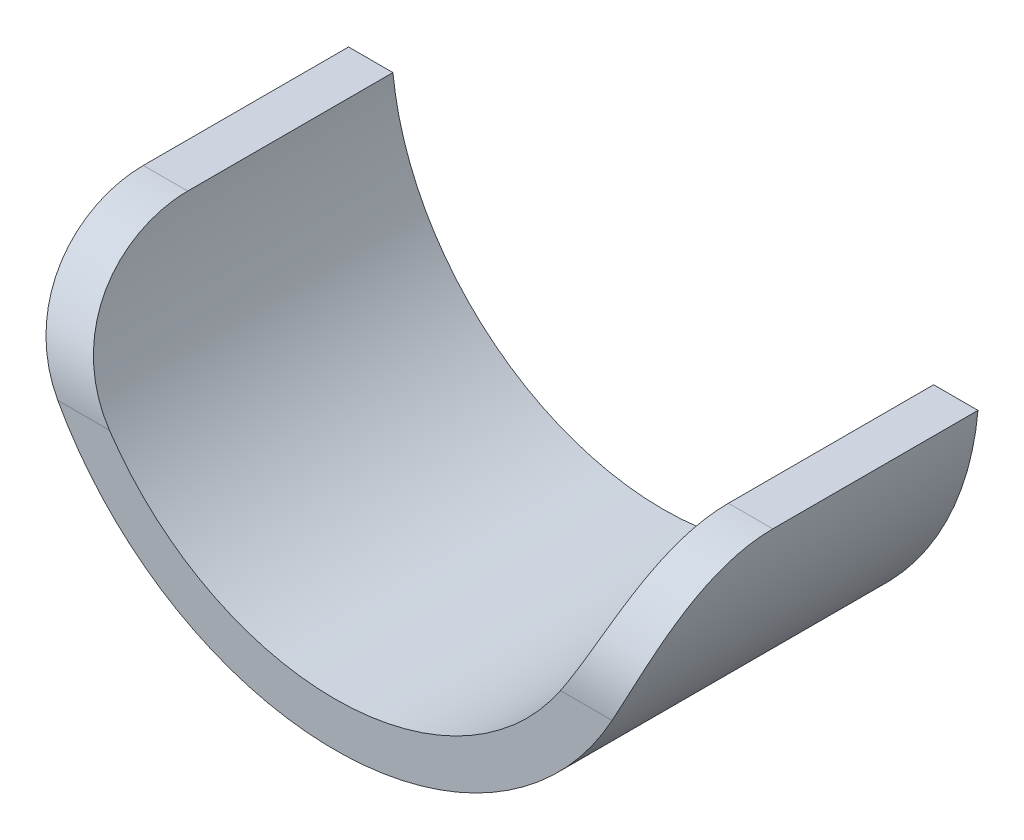
ISO-10303-21;
HEADER;
FILE_DESCRIPTION(('STEP AP214'),'2;1');
FILE_NAME('part.step','',(''),(''),'','','');
FILE_SCHEMA(('AUTOMOTIVE_DESIGN { 1 0 10303 214 1 1 1 1 }'));
ENDSEC;
DATA;
#1=APPLICATION_CONTEXT('core data for automotive mechanical design processes');
#2=APPLICATION_PROTOCOL_DEFINITION('international standard','automotive_design',2000,#1);
#3=PRODUCT_CONTEXT('',#1,'mechanical');
#4=PRODUCT('Part','Part','',(#3));
#5=PRODUCT_RELATED_PRODUCT_CATEGORY('part','',(#4));
#6=PRODUCT_DEFINITION_FORMATION('','',#4);
#7=PRODUCT_DEFINITION_CONTEXT('part definition',#1,'design');
#8=PRODUCT_DEFINITION('design','',#6,#7);
#9=PRODUCT_DEFINITION_SHAPE('','',#8);
#10=(LENGTH_UNIT() NAMED_UNIT(*) SI_UNIT(.MILLI.,.METRE.));
#11=(NAMED_UNIT(*) PLANE_ANGLE_UNIT() SI_UNIT($,.RADIAN.));
#12=(NAMED_UNIT(*) SI_UNIT($,.STERADIAN.) SOLID_ANGLE_UNIT());
#13=UNCERTAINTY_MEASURE_WITH_UNIT(LENGTH_MEASURE(1.E-05),#10,'distance_accuracy_value','');
#14=(GEOMETRIC_REPRESENTATION_CONTEXT(3) GLOBAL_UNCERTAINTY_ASSIGNED_CONTEXT((#13)) GLOBAL_UNIT_ASSIGNED_CONTEXT((#10,
#11,#12)) REPRESENTATION_CONTEXT('',''));
#15=CARTESIAN_POINT('',(0.,0.,0.));
#16=DIRECTION('',(0.,0.,1.));
#17=DIRECTION('',(1.,0.,0.));
#18=AXIS2_PLACEMENT_3D('',#15,#16,#17);
#19=CARTESIAN_POINT('',(-49.452517213227,70.5784102954188,0.));
#20=DIRECTION('',(0.,0.,1.));
#21=DIRECTION('',(1.,0.,0.));
#22=AXIS2_PLACEMENT_3D('',#19,#20,#21);
#23=CYLINDRICAL_SURFACE('',#22,21.0312);
#24=DIRECTION('',(0.,0.,1.));
#25=VECTOR('',#24,1.);
#26=CARTESIAN_POINT('',(-28.5390797341802,68.3559102954188,0.));
#27=LINE('',#26,#25);
#28=CARTESIAN_POINT('',(-28.5390797341802,68.3559102954188,0.));
#29=VERTEX_POINT('',#28);
#30=CARTESIAN_POINT('',(-28.5390797341802,68.3559102954188,15.875));
#31=VERTEX_POINT('',#30);
#32=EDGE_CURVE('E79',#29,#31,#27,.T.);
#33=ORIENTED_EDGE('',*,*,#32,.F.);
#34=CARTESIAN_POINT('',(-49.452517213227,70.5784102954188,0.));
#35=DIRECTION('',(0.,0.,1.));
#36=DIRECTION('',(1.,0.,0.));
#37=AXIS2_PLACEMENT_3D('',#34,#35,#36);
#38=CIRCLE('',#37,21.0312);
#39=CARTESIAN_POINT('',(-70.3659546922738,68.3559102954188,0.));
#40=VERTEX_POINT('',#39);
#41=EDGE_CURVE('E21',#29,#40,#38,.F.);
#42=ORIENTED_EDGE('',*,*,#41,.T.);
#43=DIRECTION('',(0.,0.,1.));
#44=VECTOR('',#43,1.);
#45=CARTESIAN_POINT('',(-70.3659546922738,68.3559102954188,0.));
#46=LINE('',#45,#44);
#47=CARTESIAN_POINT('',(-70.3659546922738,68.3559102954188,15.875));
#48=VERTEX_POINT('',#47);
#49=EDGE_CURVE('E94',#48,#40,#46,.F.);
#50=ORIENTED_EDGE('',*,*,#49,.F.);
#51=CARTESIAN_POINT('',(-66.8969322848194,58.8309102954188,25.4));
#52=CARTESIAN_POINT('',(-67.0552544886792,59.0659323458779,25.4000223165937));
#53=CARTESIAN_POINT('',(-67.2088070850555,59.3042788469614,25.3913001358398));
#54=CARTESIAN_POINT('',(-67.5056920364701,59.7861027177401,25.3550603951115));
#55=CARTESIAN_POINT('',(-67.6490162181507,60.0295839936756,25.3275279858859));
#56=CARTESIAN_POINT('',(-67.9249520253229,60.5205680650174,25.2522368031522));
#57=CARTESIAN_POINT('',(-68.0575278431865,60.7680812486983,25.2044134841059));
#58=CARTESIAN_POINT('',(-68.3107497253412,61.264124128635,25.0874914031118));
#59=CARTESIAN_POINT('',(-68.4313989286372,61.5126535393979,25.0183982590408));
#60=CARTESIAN_POINT('',(-68.6609196821141,62.0096321139726,24.8577555248676));
#61=CARTESIAN_POINT('',(-68.7697263309325,62.2580740592438,24.7660903705651));
#62=CARTESIAN_POINT('',(-68.9745996037871,62.7508386516952,24.5601076647881));
#63=CARTESIAN_POINT('',(-69.0706650630401,62.9951609204801,24.4457880446508));
#64=CARTESIAN_POINT('',(-69.2498955560648,63.4762318935547,24.194858409047));
#65=CARTESIAN_POINT('',(-69.3330891377015,63.7129964057611,24.0582991407832));
#66=CARTESIAN_POINT('',(-69.4871936315312,64.1766299263025,23.7632437137221));
#67=CARTESIAN_POINT('',(-69.5581058048297,64.4034999488523,23.6047498102739));
#68=CARTESIAN_POINT('',(-69.6823993225229,64.8245434047757,23.2821462690892));
#69=CARTESIAN_POINT('',(-69.7367878326565,65.0198152051915,23.119853352547));
#70=CARTESIAN_POINT('',(-69.8366441450998,65.3979675157972,22.7789250447289));
#71=CARTESIAN_POINT('',(-69.8821124486974,65.5808487219216,22.6002905726256));
#72=CARTESIAN_POINT('',(-69.9649622014433,65.9325888462051,22.227752368041));
#73=CARTESIAN_POINT('',(-70.0023382664183,66.1014383826418,22.0338385857608));
#74=CARTESIAN_POINT('',(-70.0698551050343,66.423434678197,21.6322082114785));
#75=CARTESIAN_POINT('',(-70.099995846967,66.5765813684971,21.4244915589915));
#76=CARTESIAN_POINT('',(-70.1535673245214,66.8637200119019,20.9998729669769));
#77=CARTESIAN_POINT('',(-70.1770896614874,66.9979591306583,20.7831495666458));
#78=CARTESIAN_POINT('',(-70.2188684352495,67.2488146613606,20.339247528795));
#79=CARTESIAN_POINT('',(-70.2371248103863,67.3654308669517,20.1120687688893));
#80=CARTESIAN_POINT('',(-70.2691787972043,67.580118012179,19.6488760229002));
#81=CARTESIAN_POINT('',(-70.2829773870763,67.6781930184271,19.4128639878406));
#82=CARTESIAN_POINT('',(-70.3068437066333,67.8551007195252,18.933570469802));
#83=CARTESIAN_POINT('',(-70.3169117991028,67.9339352852207,18.6902896961832));
#84=CARTESIAN_POINT('',(-70.3326326637004,68.0613457872681,18.2354445333753));
#85=CARTESIAN_POINT('',(-70.3387235405181,68.1126977301863,18.0246672540239));
#86=CARTESIAN_POINT('',(-70.3489474268305,68.2009031201129,17.6000705633836));
#87=CARTESIAN_POINT('',(-70.3530806454631,68.2377581157685,17.3862514795677));
#88=CARTESIAN_POINT('',(-70.3596072613835,68.2967682226221,16.9567155095835));
#89=CARTESIAN_POINT('',(-70.362001814267,68.3189330966812,16.7409999805665));
#90=CARTESIAN_POINT('',(-70.3651678474338,68.3485113571974,16.3085236213267));
#91=CARTESIAN_POINT('',(-70.3659391437129,68.3559230713058,16.0917626753916));
#92=CARTESIAN_POINT('',(-70.3659546922738,68.3559102954188,15.875));
#93=B_SPLINE_CURVE_WITH_KNOTS('',3,(#51,#52,#53,#54,#55,#56,#57,#58,#59,#60,#61,#62,#63,#64,#65,
#66,#67,#68,#69,#70,#71,#72,#73,#74,#75,#76,#77,#78,#79,#80,#81,#82,#83,#84,#85,#86,#87,#88,#89,
#90,#91,#92),.UNSPECIFIED.,.F.,.F.,(4,2,2,2,2,2,2,2,2,2,2,2,2,2,2,2,2,2,2,2,4),(0.,
0.850069177057508,1.70081019595331,2.55427796092164,3.40752049747346,4.26522576280219,
5.12300938448019,5.97886242616629,6.8346275331647,7.6126869954961,8.39070272076813,
9.1692345189757,9.94776972898546,10.7149303049624,11.4820998632821,12.2491009638168,
13.0160274552093,13.6666131714847,14.3171293695712,14.9672128084942,15.6173699336167),.UNSPECIFIED.);
#94=CARTESIAN_POINT('',(-66.8969322848194,58.8309102954188,25.4));
#95=VERTEX_POINT('',#94);
#96=EDGE_CURVE('E119',#95,#48,#93,.T.);
#97=ORIENTED_EDGE('',*,*,#96,.F.);
#98=CARTESIAN_POINT('',(-49.452517213227,70.5784102954188,25.4));
#99=DIRECTION('',(0.,0.,1.));
#100=DIRECTION('',(1.,0.,0.));
#101=AXIS2_PLACEMENT_3D('',#98,#99,#100);
#102=CIRCLE('',#101,21.0312);
#103=CARTESIAN_POINT('',(-32.0081021416346,58.8309102954188,25.4));
#104=VERTEX_POINT('',#103);
#105=EDGE_CURVE('E127',#104,#95,#102,.F.);
#106=ORIENTED_EDGE('',*,*,#105,.F.);
#107=CARTESIAN_POINT('',(-28.5390797341802,68.3559102954188,15.875));
#108=CARTESIAN_POINT('',(-28.5391142013546,68.355939343475,16.1398670139382));
#109=CARTESIAN_POINT('',(-28.5402548882162,68.3448635346954,16.4047317584034));
#110=CARTESIAN_POINT('',(-28.5449977748069,68.3007103168477,16.9325968588688));
#111=CARTESIAN_POINT('',(-28.5485999535491,68.2676330953663,17.1955972307456));
#112=CARTESIAN_POINT('',(-28.5585141886226,68.1796913757452,17.7178413974937));
#113=CARTESIAN_POINT('',(-28.5648258617715,68.124829958455,17.9770857181967));
#114=CARTESIAN_POINT('',(-28.5806408134085,67.9937374624602,18.4900104702357));
#115=CARTESIAN_POINT('',(-28.5901440291559,67.9175068038448,18.743691010842));
#116=CARTESIAN_POINT('',(-28.6129834610961,67.7441839771652,19.2438704663273));
#117=CARTESIAN_POINT('',(-28.6263226663458,67.6470755558047,19.4903636150804));
#118=CARTESIAN_POINT('',(-28.6576089612104,67.4327971512381,19.9741655654518));
#119=CARTESIAN_POINT('',(-28.6755559716713,67.3156275126598,20.2114745247577));
#120=CARTESIAN_POINT('',(-28.7169386684408,67.0622157029794,20.6751051204218));
#121=CARTESIAN_POINT('',(-28.7403729475251,66.9259784254209,20.9014295558545));
#122=CARTESIAN_POINT('',(-28.7936879319491,66.6355777501028,21.3414684393254));
#123=CARTESIAN_POINT('',(-28.82356851396,66.4814146953202,21.55518312851));
#124=CARTESIAN_POINT('',(-28.8903509027463,66.158508439211,21.9659236247951));
#125=CARTESIAN_POINT('',(-28.9271639261132,65.9899629328477,22.1631192608108));
#126=CARTESIAN_POINT('',(-29.0089555654543,65.6382951840114,22.5422318664961));
#127=CARTESIAN_POINT('',(-29.0539341165306,65.4551730573969,22.7241489575796));
#128=CARTESIAN_POINT('',(-29.1528631627412,65.0762540393745,23.0713388734296));
#129=CARTESIAN_POINT('',(-29.2068077893987,64.8804654892568,23.2366224722856));
#130=CARTESIAN_POINT('',(-29.324396747058,64.4780775248516,23.5496398476285));
#131=CARTESIAN_POINT('',(-29.388040816974,64.271478401657,23.6973740963112));
#132=CARTESIAN_POINT('',(-29.5237661900075,63.8550970610708,23.9708999474789));
#133=CARTESIAN_POINT('',(-29.5955838890426,63.6455387041543,24.097163660142));
#134=CARTESIAN_POINT('',(-29.7492328383273,63.2202123199118,24.3318700223195));
#135=CARTESIAN_POINT('',(-29.8310640565333,63.0044443124587,24.4403127288593));
#136=CARTESIAN_POINT('',(-30.0049748934319,62.5684394740868,24.639360644988));
#137=CARTESIAN_POINT('',(-30.0970689974614,62.3481966949511,24.7299401298034));
#138=CARTESIAN_POINT('',(-30.291323314875,61.9055539376429,24.8931949707997));
#139=CARTESIAN_POINT('',(-30.3934831010586,61.6831540513816,24.9658710863647));
#140=CARTESIAN_POINT('',(-30.6078815253485,61.2375126189153,25.093881459011));
#141=CARTESIAN_POINT('',(-30.7201446452316,61.0142703564028,25.1491720494189));
#142=CARTESIAN_POINT('',(-30.9541477208969,60.5691667913567,25.2428080919879));
#143=CARTESIAN_POINT('',(-31.0758894680624,60.3473057584624,25.2811503318617));
#144=CARTESIAN_POINT('',(-31.327975004665,59.9071205524767,25.3416050571915));
#145=CARTESIAN_POINT('',(-31.4582945246274,59.6887884077823,25.3637613541451));
#146=CARTESIAN_POINT('',(-31.7271617572415,59.2563859003366,25.3929612260503));
#147=CARTESIAN_POINT('',(-31.865704584105,59.0423131059243,25.4000136842187));
#148=CARTESIAN_POINT('',(-32.0081021416346,58.8309102954188,25.4));
#149=B_SPLINE_CURVE_WITH_KNOTS('',3,(#107,#108,#109,#110,#111,#112,#113,#114,#115,#116,#117,
#118,#119,#120,#121,#122,#123,#124,#125,#126,#127,#128,#129,#130,#131,#132,#133,#134,#135,#136,
#137,#138,#139,#140,#141,#142,#143,#144,#145,#146,#147,#148),.UNSPECIFIED.,.F.,.F.,(4,2,2,2,2,2,
2,2,2,2,2,2,2,2,2,2,2,2,2,2,4),(0.,0.794364250872307,1.58872172898608,2.38296690436665,
3.17719646709986,3.97204658943479,4.76688305855899,5.5615159125989,6.35613356529251,
7.1411926113294,7.92624541814851,8.71078640108747,9.49530626980127,10.2593476802903,
11.0233866458804,11.7885179934618,12.5536168818675,13.320622372447,14.0877731743138,
14.8528397088216,15.6174561511034),.UNSPECIFIED.);
#150=EDGE_CURVE('E81',#31,#104,#149,.T.);
#151=ORIENTED_EDGE('',*,*,#150,.F.);
#152=EDGE_LOOP('',(#33,#42,#50,#97,#106,#151));
#153=FACE_BOUND('',#152,.T.);
#154=ADVANCED_FACE('F17',(#153),#23,.F.);
#155=CARTESIAN_POINT('',(-49.452517213227,57.0124976223337,0.));
#156=DIRECTION('',(0.,0.,1.));
#157=DIRECTION('',(1.,0.,0.));
#158=AXIS2_PLACEMENT_3D('',#155,#156,#157);
#159=PLANE('',#158);
#160=ORIENTED_EDGE('',*,*,#41,.F.);
#161=DIRECTION('',(1.,0.,0.));
#162=VECTOR('',#161,1.);
#163=CARTESIAN_POINT('',(-28.5390797341803,68.3559102954188,0.));
#164=LINE('',#163,#162);
#165=CARTESIAN_POINT('',(-25.1062495321224,68.3559102954188,0.));
#166=VERTEX_POINT('',#165);
#167=EDGE_CURVE('E71',#166,#29,#164,.F.);
#168=ORIENTED_EDGE('',*,*,#167,.F.);
#169=CARTESIAN_POINT('',(-49.452517213227,70.5784102954188,0.));
#170=DIRECTION('',(0.,0.,1.));
#171=DIRECTION('',(1.,0.,0.));
#172=AXIS2_PLACEMENT_3D('',#169,#170,#171);
#173=CIRCLE('',#172,24.4475);
#174=CARTESIAN_POINT('',(-73.7987848943316,68.3559102954188,0.));
#175=VERTEX_POINT('',#174);
#176=EDGE_CURVE('E95',#175,#166,#173,.T.);
#177=ORIENTED_EDGE('',*,*,#176,.F.);
#178=DIRECTION('',(1.,0.,0.));
#179=VECTOR('',#178,1.);
#180=CARTESIAN_POINT('',(-73.7987848943316,68.3559102954188,0.));
#181=LINE('',#180,#179);
#182=EDGE_CURVE('E74',#40,#175,#181,.F.);
#183=ORIENTED_EDGE('',*,*,#182,.F.);
#184=EDGE_LOOP('',(#160,#168,#177,#183));
#185=FACE_BOUND('',#184,.T.);
#186=ADVANCED_FACE('F69',(#185),#159,.F.);
#187=CARTESIAN_POINT('',(-28.5390797341803,68.3559102954188,0.));
#188=DIRECTION('',(0.,1.,0.));
#189=DIRECTION('',(0.,0.,1.));
#190=AXIS2_PLACEMENT_3D('',#187,#188,#189);
#191=PLANE('',#190);
#192=DIRECTION('',(1.,0.,0.));
#193=VECTOR('',#192,1.);
#194=CARTESIAN_POINT('',(-38.9957984737035,68.3559102954188,15.875));
#195=LINE('',#194,#193);
#196=CARTESIAN_POINT('',(-25.1062495321224,68.3559102954188,15.875));
#197=VERTEX_POINT('',#196);
#198=EDGE_CURVE('E92',#197,#31,#195,.F.);
#199=ORIENTED_EDGE('',*,*,#198,.F.);
#200=DIRECTION('',(0.,0.,1.));
#201=VECTOR('',#200,1.);
#202=CARTESIAN_POINT('',(-25.1062495321224,68.3559102954188,0.));
#203=LINE('',#202,#201);
#204=EDGE_CURVE('E87',#166,#197,#203,.T.);
#205=ORIENTED_EDGE('',*,*,#204,.F.);
#206=ORIENTED_EDGE('',*,*,#167,.T.);
#207=ORIENTED_EDGE('',*,*,#32,.T.);
#208=EDGE_LOOP('',(#199,#205,#206,#207));
#209=FACE_BOUND('',#208,.T.);
#210=ADVANCED_FACE('F85',(#209),#191,.T.);
#211=CARTESIAN_POINT('',(-38.9957984737035,58.8309102954188,15.875));
#212=DIRECTION('',(1.,0.,0.));
#213=DIRECTION('',(0.,0.,-1.));
#214=AXIS2_PLACEMENT_3D('',#211,#212,#213);
#215=CYLINDRICAL_SURFACE('',#214,9.525);
#216=CARTESIAN_POINT('',(-25.1062495321224,68.3559102954188,15.875));
#217=CARTESIAN_POINT('',(-25.1062794182222,68.355939289013,16.1406587450787));
#218=CARTESIAN_POINT('',(-25.1072650314546,68.3447973908505,16.4063147471648));
#219=CARTESIAN_POINT('',(-25.1113636911725,68.3003799556767,16.9357487854177));
#220=CARTESIAN_POINT('',(-25.1144766979883,68.2671048313855,17.1995268565098));
#221=CARTESIAN_POINT('',(-25.1230448036789,68.1786425497196,17.7232628183113));
#222=CARTESIAN_POINT('',(-25.1284991888284,68.1234620701662,17.9832218482288));
#223=CARTESIAN_POINT('',(-25.1421673489193,67.9916043532497,18.4975516871316));
#224=CARTESIAN_POINT('',(-25.1503810748437,67.9149274977529,18.7519225952988));
#225=CARTESIAN_POINT('',(-25.1701225115088,67.7405852457916,19.2534385254365));
#226=CARTESIAN_POINT('',(-25.1816525551007,67.6429050868851,19.5005783254095));
#227=CARTESIAN_POINT('',(-25.2086974516839,67.4273384134945,19.9856553708156));
#228=CARTESIAN_POINT('',(-25.2242122541399,67.3094521552733,20.2235927329113));
#229=CARTESIAN_POINT('',(-25.2599893150932,67.0544331040269,20.6884777653377));
#230=CARTESIAN_POINT('',(-25.2802504789706,66.9173047515894,20.9154279550222));
#231=CARTESIAN_POINT('',(-25.3263498108991,66.6249058717589,21.3567254564923));
#232=CARTESIAN_POINT('',(-25.3521878930276,66.4696356238916,21.5710729623805));
#233=CARTESIAN_POINT('',(-25.4100309114188,66.1437470511981,21.9837267762967));
#234=CARTESIAN_POINT('',(-25.4419784080376,65.9732790121655,22.1821598082104));
#235=CARTESIAN_POINT('',(-25.5129957338972,65.6173122424646,22.5636798258997));
#236=CARTESIAN_POINT('',(-25.5520655286617,65.4318135845561,22.746766885953));
#237=CARTESIAN_POINT('',(-25.6380554565465,65.0475512936221,23.0962476410932));
#238=CARTESIAN_POINT('',(-25.684972049953,64.848793665951,23.2626488093378));
#239=CARTESIAN_POINT('',(-25.7873097124542,64.4397920218163,23.5777730993106));
#240=CARTESIAN_POINT('',(-25.8427305846889,64.2295482713098,23.7264966301056));
#241=CARTESIAN_POINT('',(-25.961412935882,63.8037392642261,24.00271480155));
#242=CARTESIAN_POINT('',(-26.0245013298024,63.5883565328607,24.1305654932742));
#243=CARTESIAN_POINT('',(-26.1596506288141,63.1504140363118,24.3679114252697));
#244=CARTESIAN_POINT('',(-26.2317116155073,62.9278542058693,24.4774064985832));
#245=CARTESIAN_POINT('',(-26.3850185741505,62.4773342177492,24.6778442802186));
#246=CARTESIAN_POINT('',(-26.4662732964222,62.2493690813373,24.7687690791281));
#247=CARTESIAN_POINT('',(-26.6378736954581,61.7902164755443,24.9319026085443));
#248=CARTESIAN_POINT('',(-26.7282186524823,61.5590292625252,25.0041128192051));
#249=CARTESIAN_POINT('',(-26.9085557066922,61.1179036853411,25.1239091993097));
#250=CARTESIAN_POINT('',(-26.9977241024106,60.908090265423,25.1732093144912));
#251=CARTESIAN_POINT('',(-27.1830608236447,60.4886055376733,25.2570799539002));
#252=CARTESIAN_POINT('',(-27.2792294211144,60.2789342356826,25.291649905511));
#253=CARTESIAN_POINT('',(-27.4779945066406,59.8614201022567,25.3464249237933));
#254=CARTESIAN_POINT('',(-27.5805747754399,59.6535740620191,25.3666647580956));
#255=CARTESIAN_POINT('',(-27.7919470287728,59.2402420222756,25.3934558910032));
#256=CARTESIAN_POINT('',(-27.9007371799733,59.0347553475176,25.4000112084111));
#257=CARTESIAN_POINT('',(-28.0124495827366,58.8309102954188,25.4));
#258=B_SPLINE_CURVE_WITH_KNOTS('',3,(#216,#217,#218,#219,#220,#221,#222,#223,#224,#225,#226,
#227,#228,#229,#230,#231,#232,#233,#234,#235,#236,#237,#238,#239,#240,#241,#242,#243,#244,#245,
#246,#247,#248,#249,#250,#251,#252,#253,#254,#255,#256,#257),.UNSPECIFIED.,.F.,.F.,(4,2,2,2,2,2,
2,2,2,2,2,2,2,2,2,2,2,2,2,2,4),(0.,0.796737246428706,1.59345963644868,2.38993933288703,
3.18640488138022,3.98343207658434,4.78044916427195,5.5772826221825,6.37410380429985,
7.16377221191817,7.95343679715734,8.74274611844911,9.5320371712921,10.3060065718731,
11.0799830118886,11.8547023963263,12.6293604887822,13.3285224691192,14.0277116260216,
14.7251985474629,15.4224806054855),.UNSPECIFIED.);
#259=CARTESIAN_POINT('',(-28.0124495827367,58.8309102954188,25.4));
#260=VERTEX_POINT('',#259);
#261=EDGE_CURVE('E140',#197,#260,#258,.T.);
#262=ORIENTED_EDGE('',*,*,#261,.F.);
#263=ORIENTED_EDGE('',*,*,#198,.T.);
#264=ORIENTED_EDGE('',*,*,#150,.T.);
#265=DIRECTION('',(1.,0.,0.));
#266=VECTOR('',#265,1.);
#267=CARTESIAN_POINT('',(-49.452517213227,58.8309102954188,25.4));
#268=LINE('',#267,#266);
#269=EDGE_CURVE('E129',#260,#104,#268,.F.);
#270=ORIENTED_EDGE('',*,*,#269,.F.);
#271=EDGE_LOOP('',(#262,#263,#264,#270));
#272=FACE_BOUND('',#271,.T.);
#273=ADVANCED_FACE('F134',(#272),#215,.T.);
#274=CARTESIAN_POINT('',(-49.452517213227,57.0124976223337,25.4));
#275=DIRECTION('',(0.,0.,1.));
#276=DIRECTION('',(1.,0.,0.));
#277=AXIS2_PLACEMENT_3D('',#274,#275,#276);
#278=PLANE('',#277);
#279=ORIENTED_EDGE('',*,*,#269,.T.);
#280=ORIENTED_EDGE('',*,*,#105,.T.);
#281=DIRECTION('',(1.,0.,0.));
#282=VECTOR('',#281,1.);
#283=CARTESIAN_POINT('',(-61.6256510537793,58.8309102954188,25.4));
#284=LINE('',#283,#282);
#285=CARTESIAN_POINT('',(-70.8925848437174,58.8309102954188,25.4));
#286=VERTEX_POINT('',#285);
#287=EDGE_CURVE('E126',#286,#95,#284,.T.);
#288=ORIENTED_EDGE('',*,*,#287,.F.);
#289=CARTESIAN_POINT('',(-49.452517213227,70.5784102954188,25.4));
#290=DIRECTION('',(0.,0.,1.));
#291=DIRECTION('',(1.,0.,0.));
#292=AXIS2_PLACEMENT_3D('',#289,#290,#291);
#293=CIRCLE('',#292,24.4475);
#294=EDGE_CURVE('E105',#260,#286,#293,.F.);
#295=ORIENTED_EDGE('',*,*,#294,.F.);
#296=EDGE_LOOP('',(#279,#280,#288,#295));
#297=FACE_BOUND('',#296,.T.);
#298=ADVANCED_FACE('F115',(#297),#278,.T.);
#299=CARTESIAN_POINT('',(-61.6256510537793,58.8309102954188,15.875));
#300=DIRECTION('',(1.,0.,0.));
#301=DIRECTION('',(0.,0.,-1.));
#302=AXIS2_PLACEMENT_3D('',#299,#300,#301);
#303=CYLINDRICAL_SURFACE('',#302,9.525);
#304=CARTESIAN_POINT('',(-70.8925848437174,58.8309102954188,25.4));
#305=CARTESIAN_POINT('',(-71.0266968626548,59.0755925258098,25.4000256457706));
#306=CARTESIAN_POINT('',(-71.1565868688513,59.3226722521849,25.3905709187918));
#307=CARTESIAN_POINT('',(-71.4073384066761,59.8200102851953,25.3517840634947));
#308=CARTESIAN_POINT('',(-71.528194440291,60.0702704207483,25.3224399382358));
#309=CARTESIAN_POINT('',(-71.7603745865899,60.5725821914308,25.2428716042871));
#310=CARTESIAN_POINT('',(-71.8716780626222,60.8246364914326,25.1926034977154));
#311=CARTESIAN_POINT('',(-72.083948684652,61.3278383710271,25.0705411360382));
#312=CARTESIAN_POINT('',(-72.1849179804794,61.578986128678,24.9987513703646));
#313=CARTESIAN_POINT('',(-72.376617860651,62.0791229436226,24.8329251428842));
#314=CARTESIAN_POINT('',(-72.4673052923306,62.3280991274512,24.7387997012281));
#315=CARTESIAN_POINT('',(-72.6378779024851,62.8203711804037,24.5284082958888));
#316=CARTESIAN_POINT('',(-72.7177622678843,63.0636666208367,24.4121406672935));
#317=CARTESIAN_POINT('',(-72.8667439392814,63.5415925622165,24.1580081534748));
#318=CARTESIAN_POINT('',(-72.9358590310641,63.7762368507453,24.0201796477769));
#319=CARTESIAN_POINT('',(-73.0638481153894,64.2347545003905,23.7234804891717));
#320=CARTESIAN_POINT('',(-73.1227228808604,64.4586286734998,23.5646114259783));
#321=CARTESIAN_POINT('',(-73.2271617424479,64.8784015858087,23.2383726016773));
#322=CARTESIAN_POINT('',(-73.2733592564402,65.0751672111943,23.0723185079716));
#323=CARTESIAN_POINT('',(-73.3580318631698,65.4554639498293,22.7238985809521));
#324=CARTESIAN_POINT('',(-73.3965072599205,65.6389955839075,22.5415333902014));
#325=CARTESIAN_POINT('',(-73.466489221536,65.9912883562984,22.1616334691098));
#326=CARTESIAN_POINT('',(-73.4979919980415,66.1600414351945,21.964090570558));
#327=CARTESIAN_POINT('',(-73.554796634011,66.4812175206149,21.5553157980747));
#328=CARTESIAN_POINT('',(-73.5800984942854,66.6336405292729,21.3440839259319));
#329=CARTESIAN_POINT('',(-73.6250984647816,66.9195410623861,20.9114932359871));
#330=CARTESIAN_POINT('',(-73.64484721287,67.0531838279528,20.6902488214772));
#331=CARTESIAN_POINT('',(-73.6798228662991,67.302173076768,20.2373513734024));
#332=CARTESIAN_POINT('',(-73.6950497372399,67.4175194208246,20.0056982606695));
#333=CARTESIAN_POINT('',(-73.7216889121856,67.6290165300981,19.5336644764603));
#334=CARTESIAN_POINT('',(-73.7331023072274,67.725172782431,19.2932863230781));
#335=CARTESIAN_POINT('',(-73.7527471407126,67.8976224337508,18.8054057085097));
#336=CARTESIAN_POINT('',(-73.7609790131866,67.9739185416401,18.557904224058));
#337=CARTESIAN_POINT('',(-73.7733459532473,68.0923887987073,18.1094370250623));
#338=CARTESIAN_POINT('',(-73.7779767433826,68.1383584791921,17.9094773368769));
#339=CARTESIAN_POINT('',(-73.7857653548148,68.2172963450834,17.5070007627129));
#340=CARTESIAN_POINT('',(-73.7889233871008,68.2502663927295,17.3044842473009));
#341=CARTESIAN_POINT('',(-73.7939158337533,68.3030397443443,16.897917414532));
#342=CARTESIAN_POINT('',(-73.7957514541939,68.3228550444869,16.6938686666993));
#343=CARTESIAN_POINT('',(-73.7981807484595,68.3492962939706,16.2848806494748));
#344=CARTESIAN_POINT('',(-73.7987742375292,68.3559202812222,16.0799412521494));
#345=CARTESIAN_POINT('',(-73.7987848943316,68.3559102954188,15.875));
#346=B_SPLINE_CURVE_WITH_KNOTS('',3,(#304,#305,#306,#307,#308,#309,#310,#311,#312,#313,#314,
#315,#316,#317,#318,#319,#320,#321,#322,#323,#324,#325,#326,#327,#328,#329,#330,#331,#332,#333,
#334,#335,#336,#337,#338,#339,#340,#341,#342,#343,#344,#345),.UNSPECIFIED.,.F.,.F.,(4,2,2,2,2,2,
2,2,2,2,2,2,2,2,2,2,2,2,2,2,4),(0.,0.836984414931259,1.67447413417505,2.51372980875849,
3.35281053574466,4.19529179613473,5.0378364292885,5.87897447860049,6.72004901216606,
7.5038464504336,8.28761302519436,9.0718043958299,9.85599566400656,10.6327852059722,
11.4095806571569,12.1861536762104,12.9626207159653,13.5778919193058,14.1930749509941,
14.8076962069896,15.4224088755558),.UNSPECIFIED.);
#347=CARTESIAN_POINT('',(-73.7987848943316,68.3559102954188,15.875));
#348=VERTEX_POINT('',#347);
#349=EDGE_CURVE('E27',#286,#348,#346,.T.);
#350=ORIENTED_EDGE('',*,*,#349,.F.);
#351=ORIENTED_EDGE('',*,*,#287,.T.);
#352=ORIENTED_EDGE('',*,*,#96,.T.);
#353=DIRECTION('',(1.,0.,0.));
#354=VECTOR('',#353,1.);
#355=CARTESIAN_POINT('',(-73.7987848943316,68.3559102954188,15.875));
#356=LINE('',#355,#354);
#357=EDGE_CURVE('E36',#348,#48,#356,.T.);
#358=ORIENTED_EDGE('',*,*,#357,.F.);
#359=EDGE_LOOP('',(#350,#351,#352,#358));
#360=FACE_BOUND('',#359,.T.);
#361=ADVANCED_FACE('F110',(#360),#303,.T.);
#362=CARTESIAN_POINT('',(-73.7987848943316,68.3559102954188,0.));
#363=DIRECTION('',(0.,1.,0.));
#364=DIRECTION('',(0.,0.,1.));
#365=AXIS2_PLACEMENT_3D('',#362,#363,#364);
#366=PLANE('',#365);
#367=ORIENTED_EDGE('',*,*,#357,.T.);
#368=ORIENTED_EDGE('',*,*,#49,.T.);
#369=ORIENTED_EDGE('',*,*,#182,.T.);
#370=DIRECTION('',(0.,0.,1.));
#371=VECTOR('',#370,1.);
#372=CARTESIAN_POINT('',(-73.7987848943316,68.3559102954188,0.));
#373=LINE('',#372,#371);
#374=EDGE_CURVE('E11',#348,#175,#373,.F.);
#375=ORIENTED_EDGE('',*,*,#374,.F.);
#376=EDGE_LOOP('',(#367,#368,#369,#375));
#377=FACE_BOUND('',#376,.T.);
#378=ADVANCED_FACE('F114',(#377),#366,.T.);
#379=CARTESIAN_POINT('',(-49.452517213227,70.5784102954188,0.));
#380=DIRECTION('',(0.,0.,1.));
#381=DIRECTION('',(1.,0.,0.));
#382=AXIS2_PLACEMENT_3D('',#379,#380,#381);
#383=CYLINDRICAL_SURFACE('',#382,24.4475);
#384=ORIENTED_EDGE('',*,*,#349,.T.);
#385=ORIENTED_EDGE('',*,*,#374,.T.);
#386=ORIENTED_EDGE('',*,*,#176,.T.);
#387=ORIENTED_EDGE('',*,*,#204,.T.);
#388=ORIENTED_EDGE('',*,*,#261,.T.);
#389=ORIENTED_EDGE('',*,*,#294,.T.);
#390=EDGE_LOOP('',(#384,#385,#386,#387,#388,#389));
#391=FACE_BOUND('',#390,.T.);
#392=ADVANCED_FACE('F107',(#391),#383,.T.);
#393=CLOSED_SHELL('',(#154,#186,#210,#273,#298,#361,#378,#392));
#394=MANIFOLD_SOLID_BREP('B1',#393);
#395=ADVANCED_BREP_SHAPE_REPRESENTATION('',(#18,#394),#14);
#396=SHAPE_DEFINITION_REPRESENTATION(#9,#395);
ENDSEC;
END-ISO-10303-21;
